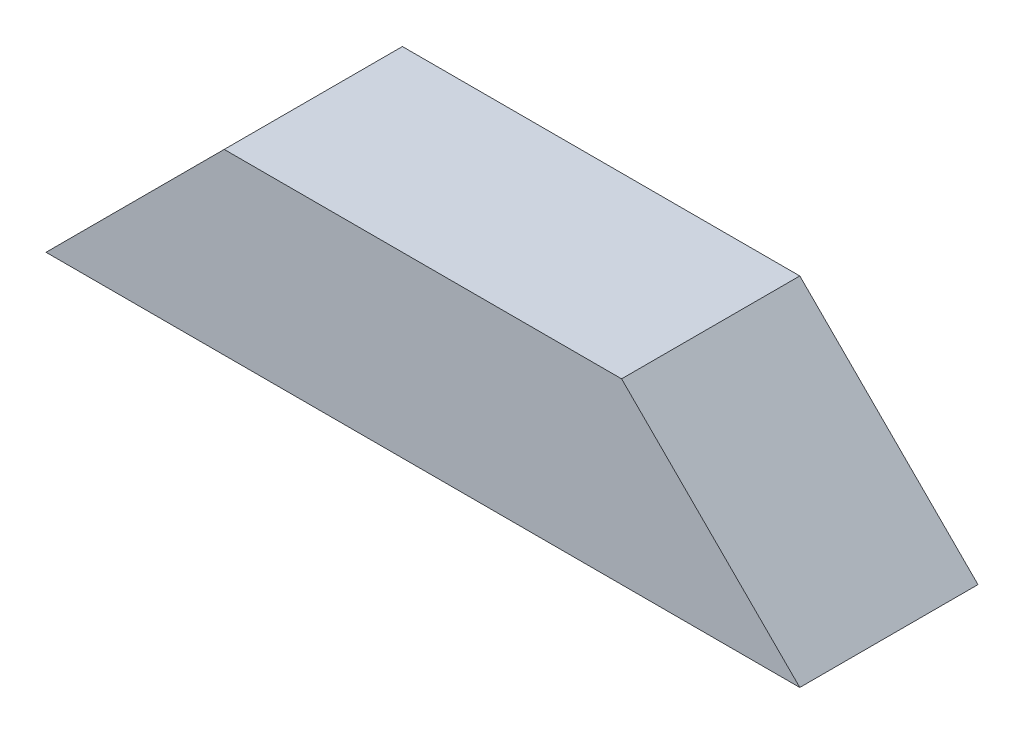
ISO-10303-21;
HEADER;
FILE_DESCRIPTION(('STEP AP214'),'2;1');
FILE_NAME('part.step','',(''),(''),'','','');
FILE_SCHEMA(('AUTOMOTIVE_DESIGN { 1 0 10303 214 1 1 1 1 }'));
ENDSEC;
DATA;
#1=APPLICATION_CONTEXT('core data for automotive mechanical design processes');
#2=APPLICATION_PROTOCOL_DEFINITION('international standard','automotive_design',2000,#1);
#3=PRODUCT_CONTEXT('',#1,'mechanical');
#4=PRODUCT('Part','Part','',(#3));
#5=PRODUCT_RELATED_PRODUCT_CATEGORY('part','',(#4));
#6=PRODUCT_DEFINITION_FORMATION('','',#4);
#7=PRODUCT_DEFINITION_CONTEXT('part definition',#1,'design');
#8=PRODUCT_DEFINITION('design','',#6,#7);
#9=PRODUCT_DEFINITION_SHAPE('','',#8);
#10=(LENGTH_UNIT() NAMED_UNIT(*) SI_UNIT(.MILLI.,.METRE.));
#11=(NAMED_UNIT(*) PLANE_ANGLE_UNIT() SI_UNIT($,.RADIAN.));
#12=(NAMED_UNIT(*) SI_UNIT($,.STERADIAN.) SOLID_ANGLE_UNIT());
#13=UNCERTAINTY_MEASURE_WITH_UNIT(LENGTH_MEASURE(1.E-05),#10,'distance_accuracy_value','');
#14=(GEOMETRIC_REPRESENTATION_CONTEXT(3) GLOBAL_UNCERTAINTY_ASSIGNED_CONTEXT((#13)) GLOBAL_UNIT_ASSIGNED_CONTEXT((#10,
#11,#12)) REPRESENTATION_CONTEXT('',''));
#15=CARTESIAN_POINT('',(0.,0.,0.));
#16=DIRECTION('',(0.,0.,1.));
#17=DIRECTION('',(1.,0.,0.));
#18=AXIS2_PLACEMENT_3D('',#15,#16,#17);
#19=CARTESIAN_POINT('',(38.3435338017587,49.9221038188344,10.));
#20=DIRECTION('',(0.707106781186548,-0.707106781186547,0.));
#21=DIRECTION('',(0.707106781186547,0.707106781186548,0.));
#22=AXIS2_PLACEMENT_3D('',#19,#20,#21);
#23=PLANE('',#22);
#24=DIRECTION('',(-0.707106781186547,-0.707106781186548,0.));
#25=VECTOR('',#24,1.);
#26=CARTESIAN_POINT('',(38.3435338017587,49.9221038188344,0.));
#27=LINE('',#26,#25);
#28=CARTESIAN_POINT('',(48.3435338017587,59.9221038188345,0.));
#29=VERTEX_POINT('',#28);
#30=CARTESIAN_POINT('',(38.3435338017587,49.9221038188344,0.));
#31=VERTEX_POINT('',#30);
#32=EDGE_CURVE('E98',#29,#31,#27,.T.);
#33=ORIENTED_EDGE('',*,*,#32,.T.);
#34=DIRECTION('',(0.,0.,-1.));
#35=VECTOR('',#34,1.);
#36=CARTESIAN_POINT('',(38.3435338017587,49.9221038188344,10.));
#37=LINE('',#36,#35);
#38=CARTESIAN_POINT('',(38.3435338017587,49.9221038188344,10.));
#39=VERTEX_POINT('',#38);
#40=EDGE_CURVE('E11',#39,#31,#37,.T.);
#41=ORIENTED_EDGE('',*,*,#40,.F.);
#42=DIRECTION('',(-0.707106781186547,-0.707106781186548,0.));
#43=VECTOR('',#42,1.);
#44=CARTESIAN_POINT('',(38.3435338017587,49.9221038188344,10.));
#45=LINE('',#44,#43);
#46=CARTESIAN_POINT('',(48.3435338017587,59.9221038188345,10.));
#47=VERTEX_POINT('',#46);
#48=EDGE_CURVE('E86',#47,#39,#45,.T.);
#49=ORIENTED_EDGE('',*,*,#48,.F.);
#50=DIRECTION('',(0.,0.,-1.));
#51=VECTOR('',#50,1.);
#52=CARTESIAN_POINT('',(48.3435338017587,59.9221038188345,10.));
#53=LINE('',#52,#51);
#54=EDGE_CURVE('E94',#47,#29,#53,.T.);
#55=ORIENTED_EDGE('',*,*,#54,.T.);
#56=EDGE_LOOP('',(#33,#41,#49,#55));
#57=FACE_BOUND('',#56,.T.);
#58=ADVANCED_FACE('F35',(#57),#23,.F.);
#59=CARTESIAN_POINT('',(38.3435338017587,49.9221038188344,10.));
#60=DIRECTION('',(0.,1.,0.));
#61=DIRECTION('',(0.,0.,1.));
#62=AXIS2_PLACEMENT_3D('',#59,#60,#61);
#63=PLANE('',#62);
#64=DIRECTION('',(1.,0.,0.));
#65=VECTOR('',#64,1.);
#66=CARTESIAN_POINT('',(38.3435338017587,49.9221038188344,0.));
#67=LINE('',#66,#65);
#68=CARTESIAN_POINT('',(80.6435338017588,49.9221038188344,0.));
#69=VERTEX_POINT('',#68);
#70=EDGE_CURVE('E90',#31,#69,#67,.T.);
#71=ORIENTED_EDGE('',*,*,#70,.T.);
#72=DIRECTION('',(0.,0.,-1.));
#73=VECTOR('',#72,1.);
#74=CARTESIAN_POINT('',(80.6435338017588,49.9221038188344,10.));
#75=LINE('',#74,#73);
#76=CARTESIAN_POINT('',(80.6435338017588,49.9221038188344,10.));
#77=VERTEX_POINT('',#76);
#78=EDGE_CURVE('E43',#77,#69,#75,.T.);
#79=ORIENTED_EDGE('',*,*,#78,.F.);
#80=DIRECTION('',(1.,0.,0.));
#81=VECTOR('',#80,1.);
#82=CARTESIAN_POINT('',(38.3435338017587,49.9221038188344,10.));
#83=LINE('',#82,#81);
#84=EDGE_CURVE('E81',#39,#77,#83,.T.);
#85=ORIENTED_EDGE('',*,*,#84,.F.);
#86=ORIENTED_EDGE('',*,*,#40,.T.);
#87=EDGE_LOOP('',(#71,#79,#85,#86));
#88=FACE_BOUND('',#87,.T.);
#89=ADVANCED_FACE('F89',(#88),#63,.F.);
#90=CARTESIAN_POINT('',(80.6435338017588,49.9221038188344,10.));
#91=DIRECTION('',(-0.707106781186541,-0.707106781186554,0.));
#92=DIRECTION('',(0.707106781186554,-0.707106781186541,0.));
#93=AXIS2_PLACEMENT_3D('',#90,#91,#92);
#94=PLANE('',#93);
#95=DIRECTION('',(-0.707106781186554,0.707106781186541,0.));
#96=VECTOR('',#95,1.);
#97=CARTESIAN_POINT('',(80.6435338017588,49.9221038188344,0.));
#98=LINE('',#97,#96);
#99=CARTESIAN_POINT('',(70.6435338017586,59.9221038188345,0.));
#100=VERTEX_POINT('',#99);
#101=EDGE_CURVE('E68',#69,#100,#98,.T.);
#102=ORIENTED_EDGE('',*,*,#101,.T.);
#103=DIRECTION('',(0.,0.,-1.));
#104=VECTOR('',#103,1.);
#105=CARTESIAN_POINT('',(70.6435338017586,59.9221038188345,10.));
#106=LINE('',#105,#104);
#107=CARTESIAN_POINT('',(70.6435338017586,59.9221038188345,10.));
#108=VERTEX_POINT('',#107);
#109=EDGE_CURVE('E91',#108,#100,#106,.T.);
#110=ORIENTED_EDGE('',*,*,#109,.F.);
#111=DIRECTION('',(-0.707106781186554,0.707106781186541,0.));
#112=VECTOR('',#111,1.);
#113=CARTESIAN_POINT('',(80.6435338017588,49.9221038188344,10.));
#114=LINE('',#113,#112);
#115=EDGE_CURVE('E84',#77,#108,#114,.T.);
#116=ORIENTED_EDGE('',*,*,#115,.F.);
#117=ORIENTED_EDGE('',*,*,#78,.T.);
#118=EDGE_LOOP('',(#102,#110,#116,#117));
#119=FACE_BOUND('',#118,.T.);
#120=ADVANCED_FACE('F92',(#119),#94,.F.);
#121=CARTESIAN_POINT('',(48.3435338017587,59.9221038188345,10.));
#122=DIRECTION('',(0.,-1.,0.));
#123=DIRECTION('',(0.,0.,-1.));
#124=AXIS2_PLACEMENT_3D('',#121,#122,#123);
#125=PLANE('',#124);
#126=DIRECTION('',(-1.,0.,0.));
#127=VECTOR('',#126,1.);
#128=CARTESIAN_POINT('',(48.3435338017587,59.9221038188345,0.));
#129=LINE('',#128,#127);
#130=EDGE_CURVE('E74',#100,#29,#129,.T.);
#131=ORIENTED_EDGE('',*,*,#130,.T.);
#132=ORIENTED_EDGE('',*,*,#54,.F.);
#133=DIRECTION('',(-1.,0.,0.));
#134=VECTOR('',#133,1.);
#135=CARTESIAN_POINT('',(48.3435338017587,59.9221038188345,10.));
#136=LINE('',#135,#134);
#137=EDGE_CURVE('E51',#108,#47,#136,.T.);
#138=ORIENTED_EDGE('',*,*,#137,.F.);
#139=ORIENTED_EDGE('',*,*,#109,.T.);
#140=EDGE_LOOP('',(#131,#132,#138,#139));
#141=FACE_BOUND('',#140,.T.);
#142=ADVANCED_FACE('F105',(#141),#125,.F.);
#143=CARTESIAN_POINT('',(0.,0.,10.));
#144=DIRECTION('',(0.,0.,1.));
#145=DIRECTION('',(1.,0.,0.));
#146=AXIS2_PLACEMENT_3D('',#143,#144,#145);
#147=PLANE('',#146);
#148=ORIENTED_EDGE('',*,*,#48,.T.);
#149=ORIENTED_EDGE('',*,*,#84,.T.);
#150=ORIENTED_EDGE('',*,*,#115,.T.);
#151=ORIENTED_EDGE('',*,*,#137,.T.);
#152=EDGE_LOOP('',(#148,#149,#150,#151));
#153=FACE_BOUND('',#152,.T.);
#154=ADVANCED_FACE('F82',(#153),#147,.T.);
#155=CARTESIAN_POINT('',(0.,0.,0.));
#156=DIRECTION('',(0.,0.,1.));
#157=DIRECTION('',(1.,0.,0.));
#158=AXIS2_PLACEMENT_3D('',#155,#156,#157);
#159=PLANE('',#158);
#160=ORIENTED_EDGE('',*,*,#32,.F.);
#161=ORIENTED_EDGE('',*,*,#130,.F.);
#162=ORIENTED_EDGE('',*,*,#101,.F.);
#163=ORIENTED_EDGE('',*,*,#70,.F.);
#164=EDGE_LOOP('',(#160,#161,#162,#163));
#165=FACE_BOUND('',#164,.T.);
#166=ADVANCED_FACE('F108',(#165),#159,.F.);
#167=CLOSED_SHELL('',(#58,#89,#120,#142,#154,#166));
#168=MANIFOLD_SOLID_BREP('B2',#167);
#169=ADVANCED_BREP_SHAPE_REPRESENTATION('',(#18,#168),#14);
#170=SHAPE_DEFINITION_REPRESENTATION(#9,#169);
ENDSEC;
END-ISO-10303-21;
